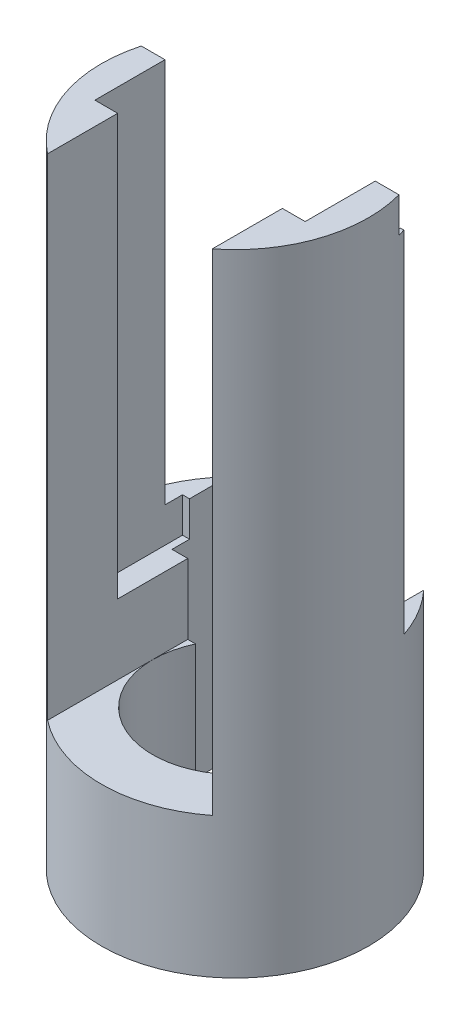
ISO-10303-21;
HEADER;
FILE_DESCRIPTION(('STEP AP214'),'2;1');
FILE_NAME('part.step','',(''),(''),'','','');
FILE_SCHEMA(('AUTOMOTIVE_DESIGN { 1 0 10303 214 1 1 1 1 }'));
ENDSEC;
DATA;
#1=APPLICATION_CONTEXT('core data for automotive mechanical design processes');
#2=APPLICATION_PROTOCOL_DEFINITION('international standard','automotive_design',2000,#1);
#3=PRODUCT_CONTEXT('',#1,'mechanical');
#4=PRODUCT('Part','Part','',(#3));
#5=PRODUCT_RELATED_PRODUCT_CATEGORY('part','',(#4));
#6=PRODUCT_DEFINITION_FORMATION('','',#4);
#7=PRODUCT_DEFINITION_CONTEXT('part definition',#1,'design');
#8=PRODUCT_DEFINITION('design','',#6,#7);
#9=PRODUCT_DEFINITION_SHAPE('','',#8);
#10=(LENGTH_UNIT() NAMED_UNIT(*) SI_UNIT(.MILLI.,.METRE.));
#11=(NAMED_UNIT(*) PLANE_ANGLE_UNIT() SI_UNIT($,.RADIAN.));
#12=(NAMED_UNIT(*) SI_UNIT($,.STERADIAN.) SOLID_ANGLE_UNIT());
#13=UNCERTAINTY_MEASURE_WITH_UNIT(LENGTH_MEASURE(1.E-05),#10,'distance_accuracy_value','');
#14=(GEOMETRIC_REPRESENTATION_CONTEXT(3) GLOBAL_UNCERTAINTY_ASSIGNED_CONTEXT((#13)) GLOBAL_UNIT_ASSIGNED_CONTEXT((#10,
#11,#12)) REPRESENTATION_CONTEXT('',''));
#15=CARTESIAN_POINT('',(0.,0.,0.));
#16=DIRECTION('',(0.,0.,1.));
#17=DIRECTION('',(1.,0.,0.));
#18=AXIS2_PLACEMENT_3D('',#15,#16,#17);
#19=CARTESIAN_POINT('',(-23.5,145.,-10.0106685636375));
#20=DIRECTION('',(0.,0.,1.));
#21=DIRECTION('',(1.,0.,0.));
#22=AXIS2_PLACEMENT_3D('',#19,#20,#21);
#23=PLANE('',#22);
#24=DIRECTION('',(-1.,0.,0.));
#25=VECTOR('',#24,1.);
#26=CARTESIAN_POINT('',(-23.5,25.,-10.0106685636375));
#27=LINE('',#26,#25);
#28=CARTESIAN_POINT('',(28.,25.,-10.0106685636375));
#29=VERTEX_POINT('',#28);
#30=CARTESIAN_POINT('',(23.5,25.,-10.0106685636375));
#31=VERTEX_POINT('',#30);
#32=EDGE_CURVE('E259',#29,#31,#27,.T.);
#33=ORIENTED_EDGE('',*,*,#32,.F.);
#34=DIRECTION('',(0.,1.,0.));
#35=VECTOR('',#34,1.);
#36=CARTESIAN_POINT('',(28.,0.,-10.0106685636375));
#37=LINE('',#36,#35);
#38=CARTESIAN_POINT('',(28.,-35.,-10.0106685636375));
#39=VERTEX_POINT('',#38);
#40=EDGE_CURVE('E341',#39,#29,#37,.T.);
#41=ORIENTED_EDGE('',*,*,#40,.F.);
#42=DIRECTION('',(1.,0.,0.));
#43=VECTOR('',#42,1.);
#44=CARTESIAN_POINT('',(-28.,-35.,-10.0106685636375));
#45=LINE('',#44,#43);
#46=CARTESIAN_POINT('',(21.2611503665488,-35.,-10.0106685636375));
#47=VERTEX_POINT('',#46);
#48=EDGE_CURVE('E328',#47,#39,#45,.T.);
#49=ORIENTED_EDGE('',*,*,#48,.F.);
#50=DIRECTION('',(0.,1.,0.));
#51=VECTOR('',#50,1.);
#52=CARTESIAN_POINT('',(21.2611503665488,-35.,-10.0106685636375));
#53=LINE('',#52,#51);
#54=CARTESIAN_POINT('',(21.2611503665488,5.,-10.0106685636375));
#55=VERTEX_POINT('',#54);
#56=EDGE_CURVE('E316',#47,#55,#53,.T.);
#57=ORIENTED_EDGE('',*,*,#56,.T.);
#58=DIRECTION('',(1.,0.,0.));
#59=VECTOR('',#58,1.);
#60=CARTESIAN_POINT('',(0.,5.,-10.0106685636375));
#61=LINE('',#60,#59);
#62=CARTESIAN_POINT('',(23.5,5.,-10.0106685636375));
#63=VERTEX_POINT('',#62);
#64=EDGE_CURVE('E469',#55,#63,#61,.T.);
#65=ORIENTED_EDGE('',*,*,#64,.T.);
#66=DIRECTION('',(0.,-1.,0.));
#67=VECTOR('',#66,1.);
#68=CARTESIAN_POINT('',(23.5,15.,-10.0106685636375));
#69=LINE('',#68,#67);
#70=EDGE_CURVE('E495',#31,#63,#69,.T.);
#71=ORIENTED_EDGE('',*,*,#70,.F.);
#72=EDGE_LOOP('',(#33,#41,#49,#57,#65,#71));
#73=FACE_BOUND('',#72,.T.);
#74=ADVANCED_FACE('F43',(#73),#23,.F.);
#75=DIRECTION('',(-1.,0.,0.));
#76=VECTOR('',#75,1.);
#77=CARTESIAN_POINT('',(-23.5,25.,-10.0106685636375));
#78=LINE('',#77,#76);
#79=CARTESIAN_POINT('',(-23.5,25.,-10.0106685636375));
#80=VERTEX_POINT('',#79);
#81=CARTESIAN_POINT('',(-28.,25.,-10.0106685636375));
#82=VERTEX_POINT('',#81);
#83=EDGE_CURVE('E59',#80,#82,#78,.T.);
#84=ORIENTED_EDGE('',*,*,#83,.F.);
#85=DIRECTION('',(0.,-1.,0.));
#86=VECTOR('',#85,1.);
#87=CARTESIAN_POINT('',(-23.5,15.,-10.0106685636375));
#88=LINE('',#87,#86);
#89=CARTESIAN_POINT('',(-23.5,5.,-10.0106685636375));
#90=VERTEX_POINT('',#89);
#91=EDGE_CURVE('E484',#80,#90,#88,.T.);
#92=ORIENTED_EDGE('',*,*,#91,.T.);
#93=CARTESIAN_POINT('',(-21.2611503665488,5.,-10.0106685636375));
#94=VERTEX_POINT('',#93);
#95=EDGE_CURVE('E470',#90,#94,#61,.T.);
#96=ORIENTED_EDGE('',*,*,#95,.T.);
#97=DIRECTION('',(0.,1.,0.));
#98=VECTOR('',#97,1.);
#99=CARTESIAN_POINT('',(-21.2611503665488,-35.,-10.0106685636375));
#100=LINE('',#99,#98);
#101=CARTESIAN_POINT('',(-21.2611503665488,-35.,-10.0106685636375));
#102=VERTEX_POINT('',#101);
#103=EDGE_CURVE('E311',#94,#102,#100,.F.);
#104=ORIENTED_EDGE('',*,*,#103,.T.);
#105=CARTESIAN_POINT('',(-28.,-35.,-10.0106685636375));
#106=VERTEX_POINT('',#105);
#107=EDGE_CURVE('E329',#106,#102,#45,.T.);
#108=ORIENTED_EDGE('',*,*,#107,.F.);
#109=DIRECTION('',(0.,1.,0.));
#110=VECTOR('',#109,1.);
#111=CARTESIAN_POINT('',(-28.,0.,-10.0106685636375));
#112=LINE('',#111,#110);
#113=EDGE_CURVE('E340',#106,#82,#112,.T.);
#114=ORIENTED_EDGE('',*,*,#113,.T.);
#115=EDGE_LOOP('',(#84,#92,#96,#104,#108,#114));
#116=FACE_BOUND('',#115,.T.);
#117=ADVANCED_FACE('F628',(#116),#23,.F.);
#118=DIRECTION('',(1.,0.,0.));
#119=VECTOR('',#118,1.);
#120=CARTESIAN_POINT('',(-35.25,35.,-10.0106685636375));
#121=LINE('',#120,#119);
#122=CARTESIAN_POINT('',(30.,35.,-10.0106685636375));
#123=VERTEX_POINT('',#122);
#124=CARTESIAN_POINT('',(35.25,35.,-10.0106685636375));
#125=VERTEX_POINT('',#124);
#126=EDGE_CURVE('E358',#123,#125,#121,.T.);
#127=ORIENTED_EDGE('',*,*,#126,.F.);
#128=DIRECTION('',(0.,1.,0.));
#129=VECTOR('',#128,1.);
#130=CARTESIAN_POINT('',(30.,135.,-10.0106685636375));
#131=LINE('',#130,#129);
#132=CARTESIAN_POINT('',(30.,145.,-10.0106685636375));
#133=VERTEX_POINT('',#132);
#134=EDGE_CURVE('E419',#123,#133,#131,.T.);
#135=ORIENTED_EDGE('',*,*,#134,.T.);
#136=DIRECTION('',(-1.,0.,0.));
#137=VECTOR('',#136,1.);
#138=CARTESIAN_POINT('',(23.5,145.,-10.0106685636375));
#139=LINE('',#138,#137);
#140=CARTESIAN_POINT('',(36.7613453903553,145.,-10.0106685636375));
#141=VERTEX_POINT('',#140);
#142=EDGE_CURVE('E443',#141,#133,#139,.T.);
#143=ORIENTED_EDGE('',*,*,#142,.F.);
#144=DIRECTION('',(0.,-1.,0.));
#145=VECTOR('',#144,1.);
#146=CARTESIAN_POINT('',(36.7613453903553,145.,-10.0106685636375));
#147=LINE('',#146,#145);
#148=CARTESIAN_POINT('',(36.7613453903553,135.,-10.0106685636375));
#149=VERTEX_POINT('',#148);
#150=EDGE_CURVE('E450',#141,#149,#147,.T.);
#151=ORIENTED_EDGE('',*,*,#150,.T.);
#152=DIRECTION('',(-1.,0.,0.));
#153=VECTOR('',#152,1.);
#154=CARTESIAN_POINT('',(36.7613453903553,135.,-10.0106685636375));
#155=LINE('',#154,#153);
#156=CARTESIAN_POINT('',(35.25,135.,-10.0106685636375));
#157=VERTEX_POINT('',#156);
#158=EDGE_CURVE('E383',#149,#157,#155,.T.);
#159=ORIENTED_EDGE('',*,*,#158,.T.);
#160=DIRECTION('',(0.,1.,0.));
#161=VECTOR('',#160,1.);
#162=CARTESIAN_POINT('',(35.25,15.,-10.0106685636375));
#163=LINE('',#162,#161);
#164=EDGE_CURVE('E387',#125,#157,#163,.T.);
#165=ORIENTED_EDGE('',*,*,#164,.F.);
#166=EDGE_LOOP('',(#127,#135,#143,#151,#159,#165));
#167=FACE_BOUND('',#166,.T.);
#168=ADVANCED_FACE('F544',(#167),#23,.F.);
#169=CARTESIAN_POINT('',(0.,5.,0.));
#170=DIRECTION('',(0.,1.,0.));
#171=DIRECTION('',(0.,0.,1.));
#172=AXIS2_PLACEMENT_3D('',#169,#170,#171);
#173=PLANE('',#172);
#174=CARTESIAN_POINT('',(0.,5.,0.));
#175=DIRECTION('',(0.,1.,0.));
#176=DIRECTION('',(0.,0.,1.));
#177=AXIS2_PLACEMENT_3D('',#174,#175,#176);
#178=CIRCLE('',#177,23.5);
#179=CARTESIAN_POINT('',(23.5,5.,0.));
#180=VERTEX_POINT('',#179);
#181=EDGE_CURVE('E308',#180,#55,#178,.T.);
#182=ORIENTED_EDGE('',*,*,#181,.F.);
#183=DIRECTION('',(0.,0.,1.));
#184=VECTOR('',#183,1.);
#185=CARTESIAN_POINT('',(23.5,5.,0.));
#186=LINE('',#185,#184);
#187=EDGE_CURVE('E475',#63,#180,#186,.T.);
#188=ORIENTED_EDGE('',*,*,#187,.F.);
#189=ORIENTED_EDGE('',*,*,#64,.F.);
#190=EDGE_LOOP('',(#182,#188,#189));
#191=FACE_BOUND('',#190,.T.);
#192=ADVANCED_FACE('F612',(#191),#173,.T.);
#193=CARTESIAN_POINT('',(-23.5,5.,0.));
#194=VERTEX_POINT('',#193);
#195=EDGE_CURVE('E312',#94,#194,#178,.T.);
#196=ORIENTED_EDGE('',*,*,#195,.F.);
#197=ORIENTED_EDGE('',*,*,#95,.F.);
#198=DIRECTION('',(0.,0.,-1.));
#199=VECTOR('',#198,1.);
#200=CARTESIAN_POINT('',(-23.5,5.,0.));
#201=LINE('',#200,#199);
#202=EDGE_CURVE('E479',#194,#90,#201,.T.);
#203=ORIENTED_EDGE('',*,*,#202,.F.);
#204=EDGE_LOOP('',(#196,#197,#203));
#205=FACE_BOUND('',#204,.T.);
#206=ADVANCED_FACE('F626',(#205),#173,.T.);
#207=CARTESIAN_POINT('',(0.,0.,-12.0106685636375));
#208=DIRECTION('',(0.,0.,-1.));
#209=DIRECTION('',(-1.,0.,0.));
#210=AXIS2_PLACEMENT_3D('',#207,#208,#209);
#211=PLANE('',#210);
#212=DIRECTION('',(1.,0.,0.));
#213=VECTOR('',#212,1.);
#214=CARTESIAN_POINT('',(-36.1573483631537,35.,-12.0106685636375));
#215=LINE('',#214,#213);
#216=CARTESIAN_POINT('',(-36.1573483631537,35.,-12.0106685636375));
#217=VERTEX_POINT('',#216);
#218=CARTESIAN_POINT('',(-35.25,35.,-12.0106685636375));
#219=VERTEX_POINT('',#218);
#220=EDGE_CURVE('E295',#217,#219,#215,.T.);
#221=ORIENTED_EDGE('',*,*,#220,.F.);
#222=DIRECTION('',(0.,-1.,0.));
#223=VECTOR('',#222,1.);
#224=CARTESIAN_POINT('',(-36.1573483631537,145.,-12.0106685636375));
#225=LINE('',#224,#223);
#226=CARTESIAN_POINT('',(-36.1573483631537,135.,-12.0106685636375));
#227=VERTEX_POINT('',#226);
#228=EDGE_CURVE('E371',#217,#227,#225,.F.);
#229=ORIENTED_EDGE('',*,*,#228,.T.);
#230=DIRECTION('',(1.,0.,0.));
#231=VECTOR('',#230,1.);
#232=CARTESIAN_POINT('',(-36.7613453903553,135.,-12.0106685636375));
#233=LINE('',#232,#231);
#234=CARTESIAN_POINT('',(-35.25,135.,-12.0106685636375));
#235=VERTEX_POINT('',#234);
#236=EDGE_CURVE('E397',#227,#235,#233,.T.);
#237=ORIENTED_EDGE('',*,*,#236,.T.);
#238=DIRECTION('',(0.,1.,0.));
#239=VECTOR('',#238,1.);
#240=CARTESIAN_POINT('',(-35.25,15.,-12.0106685636375));
#241=LINE('',#240,#239);
#242=EDGE_CURVE('E401',#219,#235,#241,.T.);
#243=ORIENTED_EDGE('',*,*,#242,.F.);
#244=EDGE_LOOP('',(#221,#229,#237,#243));
#245=FACE_BOUND('',#244,.T.);
#246=ADVANCED_FACE('F587',(#245),#211,.T.);
#247=CARTESIAN_POINT('',(0.,35.,0.));
#248=DIRECTION('',(0.,1.,0.));
#249=DIRECTION('',(0.,0.,1.));
#250=AXIS2_PLACEMENT_3D('',#247,#248,#249);
#251=PLANE('',#250);
#252=DIRECTION('',(0.,0.,1.));
#253=VECTOR('',#252,1.);
#254=CARTESIAN_POINT('',(-30.,35.,0.));
#255=LINE('',#254,#253);
#256=CARTESIAN_POINT('',(-30.,35.,-15.0106685636375));
#257=VERTEX_POINT('',#256);
#258=CARTESIAN_POINT('',(-30.,35.,-10.0106685636375));
#259=VERTEX_POINT('',#258);
#260=EDGE_CURVE('E290',#257,#259,#255,.T.);
#261=ORIENTED_EDGE('',*,*,#260,.F.);
#262=DIRECTION('',(-1.,0.,0.));
#263=VECTOR('',#262,1.);
#264=CARTESIAN_POINT('',(0.,35.,-15.0106685636375));
#265=LINE('',#264,#263);
#266=CARTESIAN_POINT('',(-28.,35.,-15.0106685636375));
#267=VERTEX_POINT('',#266);
#268=EDGE_CURVE('E287',#267,#257,#265,.T.);
#269=ORIENTED_EDGE('',*,*,#268,.F.);
#270=DIRECTION('',(0.,0.,1.));
#271=VECTOR('',#270,1.);
#272=CARTESIAN_POINT('',(-28.,35.,0.));
#273=LINE('',#272,#271);
#274=CARTESIAN_POINT('',(-28.,35.,-25.8381500885803));
#275=VERTEX_POINT('',#274);
#276=EDGE_CURVE('E506',#275,#267,#273,.T.);
#277=ORIENTED_EDGE('',*,*,#276,.F.);
#278=CARTESIAN_POINT('',(0.,35.,0.));
#279=DIRECTION('',(0.,1.,0.));
#280=DIRECTION('',(0.,0.,1.));
#281=AXIS2_PLACEMENT_3D('',#278,#279,#280);
#282=CIRCLE('',#281,38.1);
#283=EDGE_CURVE('E294',#275,#217,#282,.T.);
#284=ORIENTED_EDGE('',*,*,#283,.T.);
#285=ORIENTED_EDGE('',*,*,#220,.T.);
#286=DIRECTION('',(0.,0.,1.));
#287=VECTOR('',#286,1.);
#288=CARTESIAN_POINT('',(-35.25,35.,-12.0106685636375));
#289=LINE('',#288,#287);
#290=CARTESIAN_POINT('',(-35.25,35.,-10.0106685636375));
#291=VERTEX_POINT('',#290);
#292=EDGE_CURVE('E355',#219,#291,#289,.T.);
#293=ORIENTED_EDGE('',*,*,#292,.T.);
#294=EDGE_CURVE('E359',#291,#259,#121,.T.);
#295=ORIENTED_EDGE('',*,*,#294,.T.);
#296=EDGE_LOOP('',(#261,#269,#277,#284,#285,#293,#295));
#297=FACE_BOUND('',#296,.T.);
#298=ADVANCED_FACE('F593',(#297),#251,.T.);
#299=CARTESIAN_POINT('',(-36.7613453903553,135.,-12.0106685636375));
#300=DIRECTION('',(0.,-1.,0.));
#301=DIRECTION('',(0.,0.,-1.));
#302=AXIS2_PLACEMENT_3D('',#299,#300,#301);
#303=PLANE('',#302);
#304=CARTESIAN_POINT('',(0.,135.,0.));
#305=DIRECTION('',(0.,-1.,0.));
#306=DIRECTION('',(0.,0.,-1.));
#307=AXIS2_PLACEMENT_3D('',#304,#305,#306);
#308=CIRCLE('',#307,38.1);
#309=CARTESIAN_POINT('',(-36.7613453903553,135.,-10.0106685636375));
#310=VERTEX_POINT('',#309);
#311=EDGE_CURVE('E374',#310,#227,#308,.T.);
#312=ORIENTED_EDGE('',*,*,#311,.F.);
#313=DIRECTION('',(1.,0.,0.));
#314=VECTOR('',#313,1.);
#315=CARTESIAN_POINT('',(-36.7613453903553,135.,-10.0106685636375));
#316=LINE('',#315,#314);
#317=CARTESIAN_POINT('',(-35.25,135.,-10.0106685636375));
#318=VERTEX_POINT('',#317);
#319=EDGE_CURVE('E391',#310,#318,#316,.T.);
#320=ORIENTED_EDGE('',*,*,#319,.T.);
#321=DIRECTION('',(0.,0.,1.));
#322=VECTOR('',#321,1.);
#323=CARTESIAN_POINT('',(-35.25,135.,-12.0106685636375));
#324=LINE('',#323,#322);
#325=EDGE_CURVE('E405',#235,#318,#324,.T.);
#326=ORIENTED_EDGE('',*,*,#325,.F.);
#327=ORIENTED_EDGE('',*,*,#236,.F.);
#328=EDGE_LOOP('',(#312,#320,#326,#327));
#329=FACE_BOUND('',#328,.T.);
#330=ADVANCED_FACE('F580',(#329),#303,.F.);
#331=CARTESIAN_POINT('',(36.7613453903553,135.,-12.0106685636375));
#332=DIRECTION('',(0.,1.,0.));
#333=DIRECTION('',(0.,0.,1.));
#334=AXIS2_PLACEMENT_3D('',#331,#332,#333);
#335=PLANE('',#334);
#336=ORIENTED_EDGE('',*,*,#158,.F.);
#337=CARTESIAN_POINT('',(0.,135.,0.));
#338=DIRECTION('',(0.,1.,0.));
#339=DIRECTION('',(0.,0.,1.));
#340=AXIS2_PLACEMENT_3D('',#337,#338,#339);
#341=CIRCLE('',#340,38.1);
#342=CARTESIAN_POINT('',(36.1573483631537,135.,-12.0106685636375));
#343=VERTEX_POINT('',#342);
#344=EDGE_CURVE('E367',#149,#343,#341,.T.);
#345=ORIENTED_EDGE('',*,*,#344,.T.);
#346=DIRECTION('',(-1.,0.,0.));
#347=VECTOR('',#346,1.);
#348=CARTESIAN_POINT('',(36.7613453903553,135.,-12.0106685636375));
#349=LINE('',#348,#347);
#350=CARTESIAN_POINT('',(35.25,135.,-12.0106685636375));
#351=VERTEX_POINT('',#350);
#352=EDGE_CURVE('E382',#343,#351,#349,.T.);
#353=ORIENTED_EDGE('',*,*,#352,.T.);
#354=DIRECTION('',(0.,0.,1.));
#355=VECTOR('',#354,1.);
#356=CARTESIAN_POINT('',(35.25,135.,-12.0106685636375));
#357=LINE('',#356,#355);
#358=EDGE_CURVE('E378',#351,#157,#357,.T.);
#359=ORIENTED_EDGE('',*,*,#358,.T.);
#360=EDGE_LOOP('',(#336,#345,#353,#359));
#361=FACE_BOUND('',#360,.T.);
#362=ADVANCED_FACE('F537',(#361),#335,.T.);
#363=DIRECTION('',(1.,0.,0.));
#364=VECTOR('',#363,1.);
#365=CARTESIAN_POINT('',(28.,35.,-12.0106685636375));
#366=LINE('',#365,#364);
#367=CARTESIAN_POINT('',(35.25,35.,-12.0106685636375));
#368=VERTEX_POINT('',#367);
#369=CARTESIAN_POINT('',(36.1573483631537,35.,-12.0106685636375));
#370=VERTEX_POINT('',#369);
#371=EDGE_CURVE('E298',#368,#370,#366,.T.);
#372=ORIENTED_EDGE('',*,*,#371,.F.);
#373=DIRECTION('',(0.,1.,0.));
#374=VECTOR('',#373,1.);
#375=CARTESIAN_POINT('',(35.25,15.,-12.0106685636375));
#376=LINE('',#375,#374);
#377=EDGE_CURVE('E388',#368,#351,#376,.T.);
#378=ORIENTED_EDGE('',*,*,#377,.T.);
#379=ORIENTED_EDGE('',*,*,#352,.F.);
#380=DIRECTION('',(0.,-1.,0.));
#381=VECTOR('',#380,1.);
#382=CARTESIAN_POINT('',(36.1573483631537,145.,-12.0106685636375));
#383=LINE('',#382,#381);
#384=EDGE_CURVE('E502',#343,#370,#383,.T.);
#385=ORIENTED_EDGE('',*,*,#384,.T.);
#386=EDGE_LOOP('',(#372,#378,#379,#385));
#387=FACE_BOUND('',#386,.T.);
#388=ADVANCED_FACE('F532',(#387),#211,.T.);
#389=DIRECTION('',(0.,1.,0.));
#390=VECTOR('',#389,1.);
#391=CARTESIAN_POINT('',(-30.,135.,-10.0106685636375));
#392=LINE('',#391,#390);
#393=CARTESIAN_POINT('',(-30.,145.,-10.0106685636375));
#394=VERTEX_POINT('',#393);
#395=EDGE_CURVE('E414',#259,#394,#392,.T.);
#396=ORIENTED_EDGE('',*,*,#395,.F.);
#397=ORIENTED_EDGE('',*,*,#294,.F.);
#398=DIRECTION('',(0.,1.,0.));
#399=VECTOR('',#398,1.);
#400=CARTESIAN_POINT('',(-35.25,15.,-10.0106685636375));
#401=LINE('',#400,#399);
#402=EDGE_CURVE('E402',#291,#318,#401,.T.);
#403=ORIENTED_EDGE('',*,*,#402,.T.);
#404=ORIENTED_EDGE('',*,*,#319,.F.);
#405=DIRECTION('',(0.,-1.,0.));
#406=VECTOR('',#405,1.);
#407=CARTESIAN_POINT('',(-36.7613453903553,145.,-10.0106685636375));
#408=LINE('',#407,#406);
#409=CARTESIAN_POINT('',(-36.7613453903553,145.,-10.0106685636375));
#410=VERTEX_POINT('',#409);
#411=EDGE_CURVE('E465',#410,#310,#408,.T.);
#412=ORIENTED_EDGE('',*,*,#411,.F.);
#413=DIRECTION('',(-1.,0.,0.));
#414=VECTOR('',#413,1.);
#415=CARTESIAN_POINT('',(-23.5,145.,-10.0106685636375));
#416=LINE('',#415,#414);
#417=EDGE_CURVE('E458',#394,#410,#416,.T.);
#418=ORIENTED_EDGE('',*,*,#417,.F.);
#419=EDGE_LOOP('',(#396,#397,#403,#404,#412,#418));
#420=FACE_BOUND('',#419,.T.);
#421=ADVANCED_FACE('F575',(#420),#23,.F.);
#422=CARTESIAN_POINT('',(0.,145.,0.));
#423=DIRECTION('',(0.,1.,0.));
#424=DIRECTION('',(0.,0.,1.));
#425=AXIS2_PLACEMENT_3D('',#422,#423,#424);
#426=PLANE('',#425);
#427=ORIENTED_EDGE('',*,*,#142,.T.);
#428=DIRECTION('',(0.,0.,-1.));
#429=VECTOR('',#428,1.);
#430=CARTESIAN_POINT('',(30.,145.,9.9893314363625));
#431=LINE('',#430,#429);
#432=CARTESIAN_POINT('',(30.,145.,9.9893314363625));
#433=VERTEX_POINT('',#432);
#434=EDGE_CURVE('E427',#433,#133,#431,.T.);
#435=ORIENTED_EDGE('',*,*,#434,.F.);
#436=DIRECTION('',(-1.,0.,0.));
#437=VECTOR('',#436,1.);
#438=CARTESIAN_POINT('',(30.,145.,9.9893314363625));
#439=LINE('',#438,#437);
#440=CARTESIAN_POINT('',(23.5,145.,9.9893314363625));
#441=VERTEX_POINT('',#440);
#442=EDGE_CURVE('E240',#433,#441,#439,.T.);
#443=ORIENTED_EDGE('',*,*,#442,.T.);
#444=DIRECTION('',(0.,0.,1.));
#445=VECTOR('',#444,1.);
#446=CARTESIAN_POINT('',(23.5,145.,-10.0106685636375));
#447=LINE('',#446,#445);
#448=CARTESIAN_POINT('',(23.5,145.,29.9893314363625));
#449=VERTEX_POINT('',#448);
#450=EDGE_CURVE('E447',#441,#449,#447,.T.);
#451=ORIENTED_EDGE('',*,*,#450,.T.);
#452=CARTESIAN_POINT('',(0.,145.,0.));
#453=DIRECTION('',(0.,1.,0.));
#454=DIRECTION('',(0.,0.,1.));
#455=AXIS2_PLACEMENT_3D('',#452,#453,#454);
#456=CIRCLE('',#455,38.1);
#457=EDGE_CURVE('E439',#449,#141,#456,.T.);
#458=ORIENTED_EDGE('',*,*,#457,.T.);
#459=EDGE_LOOP('',(#427,#435,#443,#451,#458));
#460=FACE_BOUND('',#459,.T.);
#461=ADVANCED_FACE('F550',(#460),#426,.T.);
#462=CARTESIAN_POINT('',(0.,5.,0.));
#463=DIRECTION('',(0.,-1.,0.));
#464=DIRECTION('',(0.,0.,-1.));
#465=AXIS2_PLACEMENT_3D('',#462,#463,#464);
#466=CYLINDRICAL_SURFACE('',#465,38.1);
#467=ORIENTED_EDGE('',*,*,#228,.F.);
#468=ORIENTED_EDGE('',*,*,#283,.F.);
#469=DIRECTION('',(0.,-1.,0.));
#470=VECTOR('',#469,1.);
#471=CARTESIAN_POINT('',(-28.,5.,-25.8381500885803));
#472=LINE('',#471,#470);
#473=CARTESIAN_POINT('',(-28.,-35.,-25.8381500885803));
#474=VERTEX_POINT('',#473);
#475=EDGE_CURVE('E352',#275,#474,#472,.T.);
#476=ORIENTED_EDGE('',*,*,#475,.T.);
#477=CARTESIAN_POINT('',(0.,-35.,0.));
#478=DIRECTION('',(0.,-1.,0.));
#479=DIRECTION('',(0.,0.,-1.));
#480=AXIS2_PLACEMENT_3D('',#477,#478,#479);
#481=CIRCLE('',#480,38.1);
#482=CARTESIAN_POINT('',(28.,-35.,-25.8381500885803));
#483=VERTEX_POINT('',#482);
#484=EDGE_CURVE('E320',#483,#474,#481,.T.);
#485=ORIENTED_EDGE('',*,*,#484,.F.);
#486=DIRECTION('',(0.,-1.,0.));
#487=VECTOR('',#486,1.);
#488=CARTESIAN_POINT('',(28.,5.,-25.8381500885803));
#489=LINE('',#488,#487);
#490=CARTESIAN_POINT('',(28.,35.,-25.8381500885803));
#491=VERTEX_POINT('',#490);
#492=EDGE_CURVE('E345',#483,#491,#489,.F.);
#493=ORIENTED_EDGE('',*,*,#492,.T.);
#494=CARTESIAN_POINT('',(0.,35.,0.));
#495=DIRECTION('',(0.,1.,0.));
#496=DIRECTION('',(0.,0.,1.));
#497=AXIS2_PLACEMENT_3D('',#494,#495,#496);
#498=CIRCLE('',#497,38.1);
#499=EDGE_CURVE('E301',#370,#491,#498,.T.);
#500=ORIENTED_EDGE('',*,*,#499,.F.);
#501=ORIENTED_EDGE('',*,*,#384,.F.);
#502=ORIENTED_EDGE('',*,*,#344,.F.);
#503=ORIENTED_EDGE('',*,*,#150,.F.);
#504=ORIENTED_EDGE('',*,*,#457,.F.);
#505=DIRECTION('',(0.,-1.,0.));
#506=VECTOR('',#505,1.);
#507=CARTESIAN_POINT('',(23.5,15.,29.9893314363625));
#508=LINE('',#507,#506);
#509=CARTESIAN_POINT('',(23.5,5.,29.9893314363625));
#510=VERTEX_POINT('',#509);
#511=EDGE_CURVE('E491',#449,#510,#508,.T.);
#512=ORIENTED_EDGE('',*,*,#511,.T.);
#513=CARTESIAN_POINT('',(0.,5.,0.));
#514=DIRECTION('',(0.,1.,0.));
#515=DIRECTION('',(0.,0.,1.));
#516=AXIS2_PLACEMENT_3D('',#513,#514,#515);
#517=CIRCLE('',#516,38.1);
#518=CARTESIAN_POINT('',(-23.5,5.,29.9893314363625));
#519=VERTEX_POINT('',#518);
#520=EDGE_CURVE('E498',#519,#510,#517,.T.);
#521=ORIENTED_EDGE('',*,*,#520,.F.);
#522=DIRECTION('',(0.,-1.,0.));
#523=VECTOR('',#522,1.);
#524=CARTESIAN_POINT('',(-23.5,15.,29.9893314363625));
#525=LINE('',#524,#523);
#526=CARTESIAN_POINT('',(-23.5,145.,29.9893314363625));
#527=VERTEX_POINT('',#526);
#528=EDGE_CURVE('E487',#527,#519,#525,.T.);
#529=ORIENTED_EDGE('',*,*,#528,.F.);
#530=CARTESIAN_POINT('',(0.,145.,0.));
#531=DIRECTION('',(0.,1.,0.));
#532=DIRECTION('',(0.,0.,1.));
#533=AXIS2_PLACEMENT_3D('',#530,#531,#532);
#534=CIRCLE('',#533,38.1);
#535=EDGE_CURVE('E461',#410,#527,#534,.T.);
#536=ORIENTED_EDGE('',*,*,#535,.F.);
#537=ORIENTED_EDGE('',*,*,#411,.T.);
#538=ORIENTED_EDGE('',*,*,#311,.T.);
#539=EDGE_LOOP('',(#467,#468,#476,#485,#493,#500,#501,#502,#503,#504,#512,#521,#529,#536,#537,#538));
#540=FACE_BOUND('',#539,.T.);
#541=ADVANCED_FACE('F45',(#540),#466,.T.);
#542=EDGE_CURVE('E305',#194,#180,#178,.T.);
#543=ORIENTED_EDGE('',*,*,#542,.F.);
#544=EDGE_CURVE('E480',#519,#194,#201,.T.);
#545=ORIENTED_EDGE('',*,*,#544,.F.);
#546=ORIENTED_EDGE('',*,*,#520,.T.);
#547=EDGE_CURVE('E474',#180,#510,#186,.T.);
#548=ORIENTED_EDGE('',*,*,#547,.F.);
#549=EDGE_LOOP('',(#543,#545,#546,#548));
#550=FACE_BOUND('',#549,.T.);
#551=ADVANCED_FACE('F559',(#550),#173,.T.);
#552=CARTESIAN_POINT('',(23.5,15.,0.));
#553=DIRECTION('',(1.,0.,0.));
#554=DIRECTION('',(0.,0.,-1.));
#555=AXIS2_PLACEMENT_3D('',#552,#553,#554);
#556=PLANE('',#555);
#557=DIRECTION('',(0.,1.,0.));
#558=VECTOR('',#557,1.);
#559=CARTESIAN_POINT('',(23.5,15.,9.9893314363625));
#560=LINE('',#559,#558);
#561=CARTESIAN_POINT('',(23.5,25.,9.9893314363625));
#562=VERTEX_POINT('',#561);
#563=EDGE_CURVE('E436',#562,#441,#560,.T.);
#564=ORIENTED_EDGE('',*,*,#563,.F.);
#565=DIRECTION('',(0.,0.,1.));
#566=VECTOR('',#565,1.);
#567=CARTESIAN_POINT('',(23.5,25.,0.));
#568=LINE('',#567,#566);
#569=EDGE_CURVE('E257',#31,#562,#568,.T.);
#570=ORIENTED_EDGE('',*,*,#569,.F.);
#571=ORIENTED_EDGE('',*,*,#70,.T.);
#572=ORIENTED_EDGE('',*,*,#187,.T.);
#573=ORIENTED_EDGE('',*,*,#547,.T.);
#574=ORIENTED_EDGE('',*,*,#511,.F.);
#575=ORIENTED_EDGE('',*,*,#450,.F.);
#576=EDGE_LOOP('',(#564,#570,#571,#572,#573,#574,#575));
#577=FACE_BOUND('',#576,.T.);
#578=ADVANCED_FACE('F553',(#577),#556,.F.);
#579=CARTESIAN_POINT('',(-23.5,15.,0.));
#580=DIRECTION('',(-1.,0.,0.));
#581=DIRECTION('',(0.,0.,1.));
#582=AXIS2_PLACEMENT_3D('',#579,#580,#581);
#583=PLANE('',#582);
#584=DIRECTION('',(0.,0.,-1.));
#585=VECTOR('',#584,1.);
#586=CARTESIAN_POINT('',(-23.5,25.,0.));
#587=LINE('',#586,#585);
#588=CARTESIAN_POINT('',(-23.5,25.,9.9893314363625));
#589=VERTEX_POINT('',#588);
#590=EDGE_CURVE('E277',#589,#80,#587,.T.);
#591=ORIENTED_EDGE('',*,*,#590,.F.);
#592=DIRECTION('',(0.,-1.,0.));
#593=VECTOR('',#592,1.);
#594=CARTESIAN_POINT('',(-23.5,15.,9.9893314363625));
#595=LINE('',#594,#593);
#596=CARTESIAN_POINT('',(-23.5,145.,9.9893314363625));
#597=VERTEX_POINT('',#596);
#598=EDGE_CURVE('E430',#597,#589,#595,.T.);
#599=ORIENTED_EDGE('',*,*,#598,.F.);
#600=DIRECTION('',(0.,0.,-1.));
#601=VECTOR('',#600,1.);
#602=CARTESIAN_POINT('',(-23.5,145.,29.9893314363625));
#603=LINE('',#602,#601);
#604=EDGE_CURVE('E454',#527,#597,#603,.T.);
#605=ORIENTED_EDGE('',*,*,#604,.F.);
#606=ORIENTED_EDGE('',*,*,#528,.T.);
#607=ORIENTED_EDGE('',*,*,#544,.T.);
#608=ORIENTED_EDGE('',*,*,#202,.T.);
#609=ORIENTED_EDGE('',*,*,#91,.F.);
#610=EDGE_LOOP('',(#591,#599,#605,#606,#607,#608,#609));
#611=FACE_BOUND('',#610,.T.);
#612=ADVANCED_FACE('F564',(#611),#583,.F.);
#613=CARTESIAN_POINT('',(0.,145.,0.));
#614=DIRECTION('',(0.,1.,0.));
#615=DIRECTION('',(0.,0.,1.));
#616=AXIS2_PLACEMENT_3D('',#613,#614,#615);
#617=PLANE('',#616);
#618=DIRECTION('',(0.,0.,-1.));
#619=VECTOR('',#618,1.);
#620=CARTESIAN_POINT('',(-30.,145.,9.9893314363625));
#621=LINE('',#620,#619);
#622=CARTESIAN_POINT('',(-30.,145.,9.9893314363625));
#623=VERTEX_POINT('',#622);
#624=EDGE_CURVE('E244',#623,#394,#621,.T.);
#625=ORIENTED_EDGE('',*,*,#624,.T.);
#626=ORIENTED_EDGE('',*,*,#417,.T.);
#627=ORIENTED_EDGE('',*,*,#535,.T.);
#628=ORIENTED_EDGE('',*,*,#604,.T.);
#629=EDGE_CURVE('E418',#597,#623,#439,.T.);
#630=ORIENTED_EDGE('',*,*,#629,.T.);
#631=EDGE_LOOP('',(#625,#626,#627,#628,#630));
#632=FACE_BOUND('',#631,.T.);
#633=ADVANCED_FACE('F569',(#632),#617,.T.);
#634=CARTESIAN_POINT('',(0.,0.,9.9893314363625));
#635=DIRECTION('',(0.,0.,-1.));
#636=DIRECTION('',(-1.,0.,0.));
#637=AXIS2_PLACEMENT_3D('',#634,#635,#636);
#638=PLANE('',#637);
#639=ORIENTED_EDGE('',*,*,#563,.T.);
#640=ORIENTED_EDGE('',*,*,#442,.F.);
#641=DIRECTION('',(0.,1.,0.));
#642=VECTOR('',#641,1.);
#643=CARTESIAN_POINT('',(30.,135.,9.9893314363625));
#644=LINE('',#643,#642);
#645=CARTESIAN_POINT('',(30.,25.,9.9893314363625));
#646=VERTEX_POINT('',#645);
#647=EDGE_CURVE('E234',#646,#433,#644,.T.);
#648=ORIENTED_EDGE('',*,*,#647,.F.);
#649=DIRECTION('',(-1.,0.,0.));
#650=VECTOR('',#649,1.);
#651=CARTESIAN_POINT('',(-30.,25.,9.9893314363625));
#652=LINE('',#651,#650);
#653=EDGE_CURVE('E238',#646,#562,#652,.T.);
#654=ORIENTED_EDGE('',*,*,#653,.T.);
#655=EDGE_LOOP('',(#639,#640,#648,#654));
#656=FACE_BOUND('',#655,.T.);
#657=ADVANCED_FACE('F236',(#656),#638,.T.);
#658=CARTESIAN_POINT('',(30.,135.,9.9893314363625));
#659=DIRECTION('',(-1.,0.,0.));
#660=DIRECTION('',(0.,0.,1.));
#661=AXIS2_PLACEMENT_3D('',#658,#659,#660);
#662=PLANE('',#661);
#663=ORIENTED_EDGE('',*,*,#134,.F.);
#664=DIRECTION('',(0.,0.,-1.));
#665=VECTOR('',#664,1.);
#666=CARTESIAN_POINT('',(30.,35.,0.));
#667=LINE('',#666,#665);
#668=CARTESIAN_POINT('',(30.,35.,-15.0106685636375));
#669=VERTEX_POINT('',#668);
#670=EDGE_CURVE('E13',#123,#669,#667,.T.);
#671=ORIENTED_EDGE('',*,*,#670,.T.);
#672=DIRECTION('',(0.,1.,0.));
#673=VECTOR('',#672,1.);
#674=CARTESIAN_POINT('',(30.,-50.,-15.0106685636375));
#675=LINE('',#674,#673);
#676=CARTESIAN_POINT('',(30.,25.,-15.0106685636375));
#677=VERTEX_POINT('',#676);
#678=EDGE_CURVE('E250',#677,#669,#675,.T.);
#679=ORIENTED_EDGE('',*,*,#678,.F.);
#680=DIRECTION('',(0.,0.,1.));
#681=VECTOR('',#680,1.);
#682=CARTESIAN_POINT('',(30.,25.,9.9893314363625));
#683=LINE('',#682,#681);
#684=EDGE_CURVE('E247',#677,#646,#683,.T.);
#685=ORIENTED_EDGE('',*,*,#684,.T.);
#686=ORIENTED_EDGE('',*,*,#647,.T.);
#687=ORIENTED_EDGE('',*,*,#434,.T.);
#688=EDGE_LOOP('',(#663,#671,#679,#685,#686,#687));
#689=FACE_BOUND('',#688,.T.);
#690=ADVANCED_FACE('F248',(#689),#662,.T.);
#691=ORIENTED_EDGE('',*,*,#598,.T.);
#692=CARTESIAN_POINT('',(-30.,25.,9.9893314363625));
#693=VERTEX_POINT('',#692);
#694=EDGE_CURVE('E260',#589,#693,#652,.T.);
#695=ORIENTED_EDGE('',*,*,#694,.T.);
#696=DIRECTION('',(0.,1.,0.));
#697=VECTOR('',#696,1.);
#698=CARTESIAN_POINT('',(-30.,135.,9.9893314363625));
#699=LINE('',#698,#697);
#700=EDGE_CURVE('E415',#693,#623,#699,.T.);
#701=ORIENTED_EDGE('',*,*,#700,.T.);
#702=ORIENTED_EDGE('',*,*,#629,.F.);
#703=EDGE_LOOP('',(#691,#695,#701,#702));
#704=FACE_BOUND('',#703,.T.);
#705=ADVANCED_FACE('F722',(#704),#638,.T.);
#706=CARTESIAN_POINT('',(-30.,135.,9.9893314363625));
#707=DIRECTION('',(-1.,0.,0.));
#708=DIRECTION('',(0.,0.,1.));
#709=AXIS2_PLACEMENT_3D('',#706,#707,#708);
#710=PLANE('',#709);
#711=ORIENTED_EDGE('',*,*,#395,.T.);
#712=ORIENTED_EDGE('',*,*,#624,.F.);
#713=ORIENTED_EDGE('',*,*,#700,.F.);
#714=DIRECTION('',(0.,0.,-1.));
#715=VECTOR('',#714,1.);
#716=CARTESIAN_POINT('',(-30.,25.,9.9893314363625));
#717=LINE('',#716,#715);
#718=CARTESIAN_POINT('',(-30.,25.,-15.0106685636375));
#719=VERTEX_POINT('',#718);
#720=EDGE_CURVE('E266',#693,#719,#717,.T.);
#721=ORIENTED_EDGE('',*,*,#720,.T.);
#722=DIRECTION('',(0.,1.,0.));
#723=VECTOR('',#722,1.);
#724=CARTESIAN_POINT('',(-30.,-50.,-15.0106685636375));
#725=LINE('',#724,#723);
#726=EDGE_CURVE('E252',#719,#257,#725,.T.);
#727=ORIENTED_EDGE('',*,*,#726,.T.);
#728=ORIENTED_EDGE('',*,*,#260,.T.);
#729=EDGE_LOOP('',(#711,#712,#713,#721,#727,#728));
#730=FACE_BOUND('',#729,.T.);
#731=ADVANCED_FACE('F715',(#730),#710,.F.);
#732=CARTESIAN_POINT('',(-35.25,15.,-12.0106685636375));
#733=DIRECTION('',(1.,0.,0.));
#734=DIRECTION('',(0.,0.,-1.));
#735=AXIS2_PLACEMENT_3D('',#732,#733,#734);
#736=PLANE('',#735);
#737=ORIENTED_EDGE('',*,*,#292,.F.);
#738=ORIENTED_EDGE('',*,*,#242,.T.);
#739=ORIENTED_EDGE('',*,*,#325,.T.);
#740=ORIENTED_EDGE('',*,*,#402,.F.);
#741=EDGE_LOOP('',(#737,#738,#739,#740));
#742=FACE_BOUND('',#741,.T.);
#743=ADVANCED_FACE('F583',(#742),#736,.T.);
#744=CARTESIAN_POINT('',(35.25,15.,-12.0106685636375));
#745=DIRECTION('',(1.,0.,0.));
#746=DIRECTION('',(0.,0.,-1.));
#747=AXIS2_PLACEMENT_3D('',#744,#745,#746);
#748=PLANE('',#747);
#749=ORIENTED_EDGE('',*,*,#377,.F.);
#750=DIRECTION('',(0.,0.,-1.));
#751=VECTOR('',#750,1.);
#752=CARTESIAN_POINT('',(35.25,35.,-12.0106685636375));
#753=LINE('',#752,#751);
#754=EDGE_CURVE('E363',#125,#368,#753,.T.);
#755=ORIENTED_EDGE('',*,*,#754,.F.);
#756=ORIENTED_EDGE('',*,*,#164,.T.);
#757=ORIENTED_EDGE('',*,*,#358,.F.);
#758=EDGE_LOOP('',(#749,#755,#756,#757));
#759=FACE_BOUND('',#758,.T.);
#760=ADVANCED_FACE('F539',(#759),#748,.F.);
#761=DIRECTION('',(-1.,0.,0.));
#762=VECTOR('',#761,1.);
#763=CARTESIAN_POINT('',(0.,35.,-15.0106685636375));
#764=LINE('',#763,#762);
#765=CARTESIAN_POINT('',(28.,35.,-15.0106685636375));
#766=VERTEX_POINT('',#765);
#767=EDGE_CURVE('E280',#669,#766,#764,.T.);
#768=ORIENTED_EDGE('',*,*,#767,.F.);
#769=ORIENTED_EDGE('',*,*,#670,.F.);
#770=ORIENTED_EDGE('',*,*,#126,.T.);
#771=ORIENTED_EDGE('',*,*,#754,.T.);
#772=ORIENTED_EDGE('',*,*,#371,.T.);
#773=ORIENTED_EDGE('',*,*,#499,.T.);
#774=DIRECTION('',(0.,0.,-1.));
#775=VECTOR('',#774,1.);
#776=CARTESIAN_POINT('',(28.,35.,-10.0106685636375));
#777=LINE('',#776,#775);
#778=EDGE_CURVE('E337',#766,#491,#777,.T.);
#779=ORIENTED_EDGE('',*,*,#778,.F.);
#780=EDGE_LOOP('',(#768,#769,#770,#771,#772,#773,#779));
#781=FACE_BOUND('',#780,.T.);
#782=ADVANCED_FACE('F524',(#781),#251,.T.);
#783=CARTESIAN_POINT('',(-28.,0.,-10.0106685636375));
#784=DIRECTION('',(-1.,0.,0.));
#785=DIRECTION('',(0.,0.,1.));
#786=AXIS2_PLACEMENT_3D('',#783,#784,#785);
#787=PLANE('',#786);
#788=ORIENTED_EDGE('',*,*,#276,.T.);
#789=DIRECTION('',(0.,-1.,0.));
#790=VECTOR('',#789,1.);
#791=CARTESIAN_POINT('',(-28.,0.,-15.0106685636375));
#792=LINE('',#791,#790);
#793=CARTESIAN_POINT('',(-28.,25.,-15.0106685636375));
#794=VERTEX_POINT('',#793);
#795=EDGE_CURVE('E283',#267,#794,#792,.T.);
#796=ORIENTED_EDGE('',*,*,#795,.T.);
#797=DIRECTION('',(0.,0.,-1.));
#798=VECTOR('',#797,1.);
#799=CARTESIAN_POINT('',(-28.,25.,-10.0106685636375));
#800=LINE('',#799,#798);
#801=EDGE_CURVE('E272',#82,#794,#800,.T.);
#802=ORIENTED_EDGE('',*,*,#801,.F.);
#803=ORIENTED_EDGE('',*,*,#113,.F.);
#804=DIRECTION('',(0.,0.,1.));
#805=VECTOR('',#804,1.);
#806=CARTESIAN_POINT('',(-28.,-35.,-25.8381500885803));
#807=LINE('',#806,#805);
#808=EDGE_CURVE('E324',#474,#106,#807,.T.);
#809=ORIENTED_EDGE('',*,*,#808,.F.);
#810=ORIENTED_EDGE('',*,*,#475,.F.);
#811=EDGE_LOOP('',(#788,#796,#802,#803,#809,#810));
#812=FACE_BOUND('',#811,.T.);
#813=ADVANCED_FACE('F596',(#812),#787,.F.);
#814=CARTESIAN_POINT('',(28.,0.,-10.0106685636375));
#815=DIRECTION('',(1.,0.,0.));
#816=DIRECTION('',(0.,0.,-1.));
#817=AXIS2_PLACEMENT_3D('',#814,#815,#816);
#818=PLANE('',#817);
#819=DIRECTION('',(0.,0.,1.));
#820=VECTOR('',#819,1.);
#821=CARTESIAN_POINT('',(28.,25.,-10.0106685636375));
#822=LINE('',#821,#820);
#823=CARTESIAN_POINT('',(28.,25.,-15.0106685636375));
#824=VERTEX_POINT('',#823);
#825=EDGE_CURVE('E513',#824,#29,#822,.T.);
#826=ORIENTED_EDGE('',*,*,#825,.F.);
#827=DIRECTION('',(0.,1.,0.));
#828=VECTOR('',#827,1.);
#829=CARTESIAN_POINT('',(28.,0.,-15.0106685636375));
#830=LINE('',#829,#828);
#831=EDGE_CURVE('E52',#824,#766,#830,.T.);
#832=ORIENTED_EDGE('',*,*,#831,.T.);
#833=ORIENTED_EDGE('',*,*,#778,.T.);
#834=ORIENTED_EDGE('',*,*,#492,.F.);
#835=DIRECTION('',(0.,0.,-1.));
#836=VECTOR('',#835,1.);
#837=CARTESIAN_POINT('',(28.,-35.,-10.0106685636375));
#838=LINE('',#837,#836);
#839=EDGE_CURVE('E333',#39,#483,#838,.T.);
#840=ORIENTED_EDGE('',*,*,#839,.F.);
#841=ORIENTED_EDGE('',*,*,#40,.T.);
#842=EDGE_LOOP('',(#826,#832,#833,#834,#840,#841));
#843=FACE_BOUND('',#842,.T.);
#844=ADVANCED_FACE('F520',(#843),#818,.F.);
#845=CARTESIAN_POINT('',(0.,-35.,0.));
#846=DIRECTION('',(0.,-1.,0.));
#847=DIRECTION('',(0.,0.,-1.));
#848=AXIS2_PLACEMENT_3D('',#845,#846,#847);
#849=PLANE('',#848);
#850=CARTESIAN_POINT('',(0.,-35.,0.));
#851=DIRECTION('',(0.,-1.,0.));
#852=DIRECTION('',(0.,0.,-1.));
#853=AXIS2_PLACEMENT_3D('',#850,#851,#852);
#854=CIRCLE('',#853,23.5);
#855=EDGE_CURVE('E510',#47,#102,#854,.T.);
#856=ORIENTED_EDGE('',*,*,#855,.F.);
#857=ORIENTED_EDGE('',*,*,#48,.T.);
#858=ORIENTED_EDGE('',*,*,#839,.T.);
#859=ORIENTED_EDGE('',*,*,#484,.T.);
#860=ORIENTED_EDGE('',*,*,#808,.T.);
#861=ORIENTED_EDGE('',*,*,#107,.T.);
#862=EDGE_LOOP('',(#856,#857,#858,#859,#860,#861));
#863=FACE_BOUND('',#862,.T.);
#864=ADVANCED_FACE('F600',(#863),#849,.T.);
#865=CARTESIAN_POINT('',(0.,-35.,0.));
#866=DIRECTION('',(0.,1.,0.));
#867=DIRECTION('',(0.,0.,1.));
#868=AXIS2_PLACEMENT_3D('',#865,#866,#867);
#869=CYLINDRICAL_SURFACE('',#868,23.5);
#870=ORIENTED_EDGE('',*,*,#855,.T.);
#871=ORIENTED_EDGE('',*,*,#103,.F.);
#872=ORIENTED_EDGE('',*,*,#195,.T.);
#873=ORIENTED_EDGE('',*,*,#542,.T.);
#874=ORIENTED_EDGE('',*,*,#181,.T.);
#875=ORIENTED_EDGE('',*,*,#56,.F.);
#876=EDGE_LOOP('',(#870,#871,#872,#873,#874,#875));
#877=FACE_BOUND('',#876,.T.);
#878=ADVANCED_FACE('F614',(#877),#869,.F.);
#879=CARTESIAN_POINT('',(0.,25.,0.));
#880=DIRECTION('',(0.,1.,0.));
#881=DIRECTION('',(0.,0.,1.));
#882=AXIS2_PLACEMENT_3D('',#879,#880,#881);
#883=PLANE('',#882);
#884=ORIENTED_EDGE('',*,*,#569,.T.);
#885=ORIENTED_EDGE('',*,*,#653,.F.);
#886=ORIENTED_EDGE('',*,*,#684,.F.);
#887=DIRECTION('',(1.,0.,0.));
#888=VECTOR('',#887,1.);
#889=CARTESIAN_POINT('',(-30.,25.,-15.0106685636375));
#890=LINE('',#889,#888);
#891=EDGE_CURVE('E67',#824,#677,#890,.T.);
#892=ORIENTED_EDGE('',*,*,#891,.F.);
#893=ORIENTED_EDGE('',*,*,#825,.T.);
#894=ORIENTED_EDGE('',*,*,#32,.T.);
#895=EDGE_LOOP('',(#884,#885,#886,#892,#893,#894));
#896=FACE_BOUND('',#895,.T.);
#897=ADVANCED_FACE('F255',(#896),#883,.T.);
#898=CARTESIAN_POINT('',(-30.,-50.,-15.0106685636375));
#899=DIRECTION('',(0.,0.,-1.));
#900=DIRECTION('',(-1.,0.,0.));
#901=AXIS2_PLACEMENT_3D('',#898,#899,#900);
#902=PLANE('',#901);
#903=ORIENTED_EDGE('',*,*,#767,.T.);
#904=ORIENTED_EDGE('',*,*,#831,.F.);
#905=ORIENTED_EDGE('',*,*,#891,.T.);
#906=ORIENTED_EDGE('',*,*,#678,.T.);
#907=EDGE_LOOP('',(#903,#904,#905,#906));
#908=FACE_BOUND('',#907,.T.);
#909=ADVANCED_FACE('F678',(#908),#902,.F.);
#910=ORIENTED_EDGE('',*,*,#268,.T.);
#911=ORIENTED_EDGE('',*,*,#726,.F.);
#912=EDGE_CURVE('E993',#719,#794,#890,.T.);
#913=ORIENTED_EDGE('',*,*,#912,.T.);
#914=ORIENTED_EDGE('',*,*,#795,.F.);
#915=EDGE_LOOP('',(#910,#911,#913,#914));
#916=FACE_BOUND('',#915,.T.);
#917=ADVANCED_FACE('F681',(#916),#902,.F.);
#918=ORIENTED_EDGE('',*,*,#590,.T.);
#919=ORIENTED_EDGE('',*,*,#83,.T.);
#920=ORIENTED_EDGE('',*,*,#801,.T.);
#921=ORIENTED_EDGE('',*,*,#912,.F.);
#922=ORIENTED_EDGE('',*,*,#720,.F.);
#923=ORIENTED_EDGE('',*,*,#694,.F.);
#924=EDGE_LOOP('',(#918,#919,#920,#921,#922,#923));
#925=FACE_BOUND('',#924,.T.);
#926=ADVANCED_FACE('F682',(#925),#883,.T.);
#927=CLOSED_SHELL('',(#74,#117,#168,#192,#206,#246,#298,#330,#362,#388,#421,#461,#541,#551,#578,
#612,#633,#657,#690,#705,#731,#743,#760,#782,#813,#844,#864,#878,#897,#909,#917,#926));
#928=MANIFOLD_SOLID_BREP('B2',#927);
#929=ADVANCED_BREP_SHAPE_REPRESENTATION('',(#18,#928),#14);
#930=SHAPE_DEFINITION_REPRESENTATION(#9,#929);
ENDSEC;
END-ISO-10303-21;
